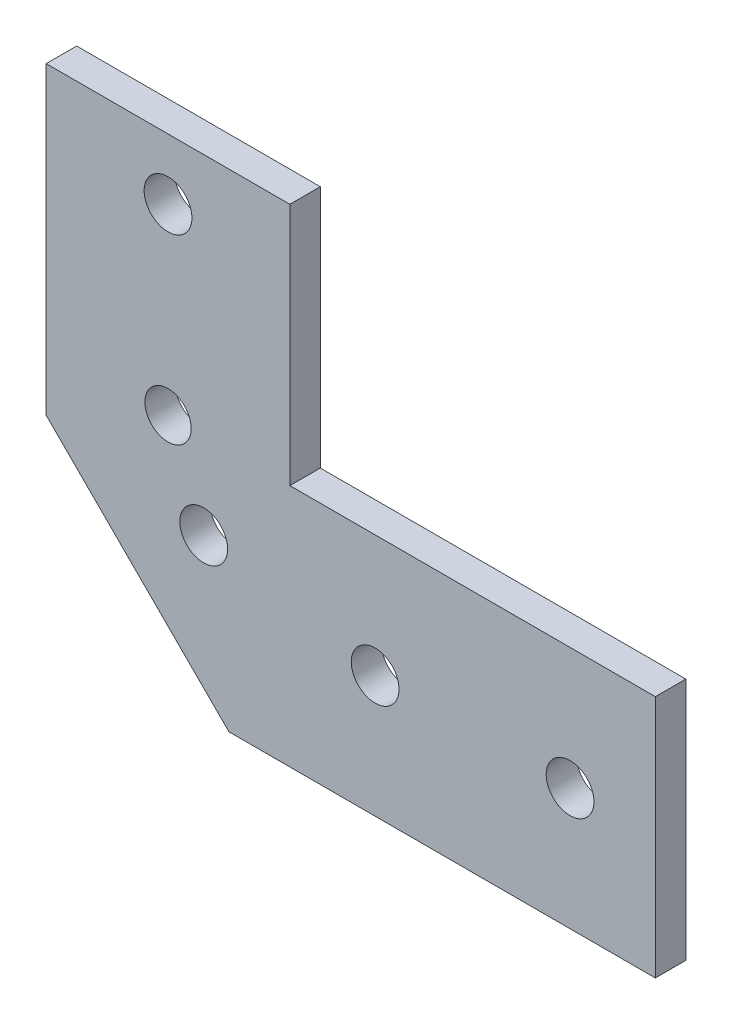
ISO-10303-21;
HEADER;
FILE_DESCRIPTION(('STEP AP214'),'2;1');
FILE_NAME('part.step','',(''),(''),'','','');
FILE_SCHEMA(('AUTOMOTIVE_DESIGN { 1 0 10303 214 1 1 1 1 }'));
ENDSEC;
DATA;
#1=APPLICATION_CONTEXT('core data for automotive mechanical design processes');
#2=APPLICATION_PROTOCOL_DEFINITION('international standard','automotive_design',2000,#1);
#3=PRODUCT_CONTEXT('',#1,'mechanical');
#4=PRODUCT('Part','Part','',(#3));
#5=PRODUCT_RELATED_PRODUCT_CATEGORY('part','',(#4));
#6=PRODUCT_DEFINITION_FORMATION('','',#4);
#7=PRODUCT_DEFINITION_CONTEXT('part definition',#1,'design');
#8=PRODUCT_DEFINITION('design','',#6,#7);
#9=PRODUCT_DEFINITION_SHAPE('','',#8);
#10=(LENGTH_UNIT() NAMED_UNIT(*) SI_UNIT(.MILLI.,.METRE.));
#11=(NAMED_UNIT(*) PLANE_ANGLE_UNIT() SI_UNIT($,.RADIAN.));
#12=(NAMED_UNIT(*) SI_UNIT($,.STERADIAN.) SOLID_ANGLE_UNIT());
#13=UNCERTAINTY_MEASURE_WITH_UNIT(LENGTH_MEASURE(1.E-05),#10,'distance_accuracy_value','');
#14=(GEOMETRIC_REPRESENTATION_CONTEXT(3) GLOBAL_UNCERTAINTY_ASSIGNED_CONTEXT((#13)) GLOBAL_UNIT_ASSIGNED_CONTEXT((#10,
#11,#12)) REPRESENTATION_CONTEXT('',''));
#15=CARTESIAN_POINT('',(0.,0.,0.));
#16=DIRECTION('',(0.,0.,1.));
#17=DIRECTION('',(1.,0.,0.));
#18=AXIS2_PLACEMENT_3D('',#15,#16,#17);
#19=CARTESIAN_POINT('',(0.,0.,3.175));
#20=DIRECTION('',(0.,1.,0.));
#21=DIRECTION('',(0.,0.,1.));
#22=AXIS2_PLACEMENT_3D('',#19,#20,#21);
#23=PLANE('',#22);
#24=DIRECTION('',(1.,0.,0.));
#25=VECTOR('',#24,1.);
#26=CARTESIAN_POINT('',(0.,0.,3.175));
#27=LINE('',#26,#25);
#28=CARTESIAN_POINT('',(19.05,0.,3.175));
#29=VERTEX_POINT('',#28);
#30=CARTESIAN_POINT('',(63.5,0.,3.175));
#31=VERTEX_POINT('',#30);
#32=EDGE_CURVE('E106',#29,#31,#27,.T.);
#33=ORIENTED_EDGE('',*,*,#32,.F.);
#34=DIRECTION('',(0.,0.,1.));
#35=VECTOR('',#34,1.);
#36=CARTESIAN_POINT('',(19.05,0.,0.));
#37=LINE('',#36,#35);
#38=CARTESIAN_POINT('',(19.05,0.,0.));
#39=VERTEX_POINT('',#38);
#40=EDGE_CURVE('E140',#39,#29,#37,.T.);
#41=ORIENTED_EDGE('',*,*,#40,.F.);
#42=DIRECTION('',(1.,0.,0.));
#43=VECTOR('',#42,1.);
#44=CARTESIAN_POINT('',(0.,0.,0.));
#45=LINE('',#44,#43);
#46=CARTESIAN_POINT('',(63.5,0.,0.));
#47=VERTEX_POINT('',#46);
#48=EDGE_CURVE('E129',#39,#47,#45,.T.);
#49=ORIENTED_EDGE('',*,*,#48,.T.);
#50=DIRECTION('',(0.,0.,-1.));
#51=VECTOR('',#50,1.);
#52=CARTESIAN_POINT('',(63.5,0.,3.175));
#53=LINE('',#52,#51);
#54=EDGE_CURVE('E11',#31,#47,#53,.T.);
#55=ORIENTED_EDGE('',*,*,#54,.F.);
#56=EDGE_LOOP('',(#33,#41,#49,#55));
#57=FACE_BOUND('',#56,.T.);
#58=ADVANCED_FACE('F32',(#57),#23,.F.);
#59=CARTESIAN_POINT('',(63.5,0.,3.175));
#60=DIRECTION('',(-1.,0.,0.));
#61=DIRECTION('',(0.,0.,1.));
#62=AXIS2_PLACEMENT_3D('',#59,#60,#61);
#63=PLANE('',#62);
#64=DIRECTION('',(0.,1.,0.));
#65=VECTOR('',#64,1.);
#66=CARTESIAN_POINT('',(63.5,0.,0.));
#67=LINE('',#66,#65);
#68=CARTESIAN_POINT('',(63.5,25.4,0.));
#69=VERTEX_POINT('',#68);
#70=EDGE_CURVE('E128',#47,#69,#67,.T.);
#71=ORIENTED_EDGE('',*,*,#70,.T.);
#72=DIRECTION('',(0.,0.,-1.));
#73=VECTOR('',#72,1.);
#74=CARTESIAN_POINT('',(63.5,25.4,3.175));
#75=LINE('',#74,#73);
#76=CARTESIAN_POINT('',(63.5,25.4,3.175));
#77=VERTEX_POINT('',#76);
#78=EDGE_CURVE('E39',#77,#69,#75,.T.);
#79=ORIENTED_EDGE('',*,*,#78,.F.);
#80=DIRECTION('',(0.,1.,0.));
#81=VECTOR('',#80,1.);
#82=CARTESIAN_POINT('',(63.5,0.,3.175));
#83=LINE('',#82,#81);
#84=EDGE_CURVE('E109',#31,#77,#83,.T.);
#85=ORIENTED_EDGE('',*,*,#84,.F.);
#86=ORIENTED_EDGE('',*,*,#54,.T.);
#87=EDGE_LOOP('',(#71,#79,#85,#86));
#88=FACE_BOUND('',#87,.T.);
#89=ADVANCED_FACE('F187',(#88),#63,.F.);
#90=CARTESIAN_POINT('',(63.5,25.4,3.175));
#91=DIRECTION('',(0.,-1.,0.));
#92=DIRECTION('',(1.,0.,0.));
#93=AXIS2_PLACEMENT_3D('',#90,#91,#92);
#94=PLANE('',#93);
#95=DIRECTION('',(-1.,0.,0.));
#96=VECTOR('',#95,1.);
#97=CARTESIAN_POINT('',(63.5,25.4,0.));
#98=LINE('',#97,#96);
#99=CARTESIAN_POINT('',(25.4,25.4,0.));
#100=VERTEX_POINT('',#99);
#101=EDGE_CURVE('E111',#69,#100,#98,.T.);
#102=ORIENTED_EDGE('',*,*,#101,.T.);
#103=DIRECTION('',(0.,0.,-1.));
#104=VECTOR('',#103,1.);
#105=CARTESIAN_POINT('',(25.4,25.4,3.175));
#106=LINE('',#105,#104);
#107=CARTESIAN_POINT('',(25.4,25.4,3.175));
#108=VERTEX_POINT('',#107);
#109=EDGE_CURVE('E115',#108,#100,#106,.T.);
#110=ORIENTED_EDGE('',*,*,#109,.F.);
#111=DIRECTION('',(-1.,0.,0.));
#112=VECTOR('',#111,1.);
#113=CARTESIAN_POINT('',(63.5,25.4,3.175));
#114=LINE('',#113,#112);
#115=EDGE_CURVE('E124',#77,#108,#114,.T.);
#116=ORIENTED_EDGE('',*,*,#115,.F.);
#117=ORIENTED_EDGE('',*,*,#78,.T.);
#118=EDGE_LOOP('',(#102,#110,#116,#117));
#119=FACE_BOUND('',#118,.T.);
#120=ADVANCED_FACE('F122',(#119),#94,.F.);
#121=CARTESIAN_POINT('',(25.4,25.4,3.175));
#122=DIRECTION('',(-1.,0.,0.));
#123=DIRECTION('',(0.,0.,1.));
#124=AXIS2_PLACEMENT_3D('',#121,#122,#123);
#125=PLANE('',#124);
#126=DIRECTION('',(0.,1.,0.));
#127=VECTOR('',#126,1.);
#128=CARTESIAN_POINT('',(25.4,25.4,0.));
#129=LINE('',#128,#127);
#130=CARTESIAN_POINT('',(25.4,50.8,0.));
#131=VERTEX_POINT('',#130);
#132=EDGE_CURVE('E107',#100,#131,#129,.T.);
#133=ORIENTED_EDGE('',*,*,#132,.T.);
#134=DIRECTION('',(0.,0.,1.));
#135=VECTOR('',#134,1.);
#136=CARTESIAN_POINT('',(25.4,50.8,0.));
#137=LINE('',#136,#135);
#138=CARTESIAN_POINT('',(25.4,50.8,3.175));
#139=VERTEX_POINT('',#138);
#140=EDGE_CURVE('E46',#131,#139,#137,.T.);
#141=ORIENTED_EDGE('',*,*,#140,.T.);
#142=DIRECTION('',(0.,1.,0.));
#143=VECTOR('',#142,1.);
#144=CARTESIAN_POINT('',(25.4,25.4,3.175));
#145=LINE('',#144,#143);
#146=EDGE_CURVE('E135',#108,#139,#145,.T.);
#147=ORIENTED_EDGE('',*,*,#146,.F.);
#148=ORIENTED_EDGE('',*,*,#109,.T.);
#149=EDGE_LOOP('',(#133,#141,#147,#148));
#150=FACE_BOUND('',#149,.T.);
#151=ADVANCED_FACE('F181',(#150),#125,.F.);
#152=CARTESIAN_POINT('',(0.,0.,3.175));
#153=DIRECTION('',(1.,0.,0.));
#154=DIRECTION('',(0.,0.,-1.));
#155=AXIS2_PLACEMENT_3D('',#152,#153,#154);
#156=PLANE('',#155);
#157=DIRECTION('',(0.,-1.,0.));
#158=VECTOR('',#157,1.);
#159=CARTESIAN_POINT('',(0.,0.,3.175));
#160=LINE('',#159,#158);
#161=CARTESIAN_POINT('',(0.,50.8,3.175));
#162=VERTEX_POINT('',#161);
#163=CARTESIAN_POINT('',(0.,19.0500000000001,3.175));
#164=VERTEX_POINT('',#163);
#165=EDGE_CURVE('E100',#162,#164,#160,.T.);
#166=ORIENTED_EDGE('',*,*,#165,.F.);
#167=DIRECTION('',(0.,0.,1.));
#168=VECTOR('',#167,1.);
#169=CARTESIAN_POINT('',(0.,50.8,0.));
#170=LINE('',#169,#168);
#171=CARTESIAN_POINT('',(0.,50.8,0.));
#172=VERTEX_POINT('',#171);
#173=EDGE_CURVE('E91',#172,#162,#170,.T.);
#174=ORIENTED_EDGE('',*,*,#173,.F.);
#175=DIRECTION('',(0.,-1.,0.));
#176=VECTOR('',#175,1.);
#177=CARTESIAN_POINT('',(0.,0.,0.));
#178=LINE('',#177,#176);
#179=CARTESIAN_POINT('',(0.,19.0500000000001,0.));
#180=VERTEX_POINT('',#179);
#181=EDGE_CURVE('E54',#172,#180,#178,.T.);
#182=ORIENTED_EDGE('',*,*,#181,.T.);
#183=DIRECTION('',(0.,0.,1.));
#184=VECTOR('',#183,1.);
#185=CARTESIAN_POINT('',(0.,19.0500000000001,0.));
#186=LINE('',#185,#184);
#187=EDGE_CURVE('E133',#180,#164,#186,.T.);
#188=ORIENTED_EDGE('',*,*,#187,.T.);
#189=EDGE_LOOP('',(#166,#174,#182,#188));
#190=FACE_BOUND('',#189,.T.);
#191=ADVANCED_FACE('F99',(#190),#156,.F.);
#192=CARTESIAN_POINT('',(0.,0.,3.175));
#193=DIRECTION('',(0.,0.,1.));
#194=DIRECTION('',(1.,0.,0.));
#195=AXIS2_PLACEMENT_3D('',#192,#193,#194);
#196=PLANE('',#195);
#197=DIRECTION('',(1.,0.,0.));
#198=VECTOR('',#197,1.);
#199=CARTESIAN_POINT('',(0.,50.8,3.175));
#200=LINE('',#199,#198);
#201=EDGE_CURVE('E96',#162,#139,#200,.T.);
#202=ORIENTED_EDGE('',*,*,#201,.F.);
#203=ORIENTED_EDGE('',*,*,#165,.T.);
#204=DIRECTION('',(-0.707106781186547,0.707106781186548,0.));
#205=VECTOR('',#204,1.);
#206=CARTESIAN_POINT('',(19.05,0.,3.175));
#207=LINE('',#206,#205);
#208=EDGE_CURVE('E143',#29,#164,#207,.T.);
#209=ORIENTED_EDGE('',*,*,#208,.F.);
#210=ORIENTED_EDGE('',*,*,#32,.T.);
#211=ORIENTED_EDGE('',*,*,#84,.T.);
#212=ORIENTED_EDGE('',*,*,#115,.T.);
#213=ORIENTED_EDGE('',*,*,#146,.T.);
#214=EDGE_LOOP('',(#202,#203,#209,#210,#211,#212,#213));
#215=FACE_BOUND('',#214,.T.);
#216=CARTESIAN_POINT('',(12.7,25.4,3.175));
#217=DIRECTION('',(0.,0.,-1.));
#218=DIRECTION('',(-1.,0.,0.));
#219=AXIS2_PLACEMENT_3D('',#216,#217,#218);
#220=CIRCLE('',#219,2.41300000000006);
#221=CARTESIAN_POINT('',(10.2869999999999,25.4,3.175));
#222=VERTEX_POINT('',#221);
#223=EDGE_CURVE('E152',#222,#222,#220,.T.);
#224=ORIENTED_EDGE('',*,*,#223,.T.);
#225=EDGE_LOOP('',(#224));
#226=FACE_BOUND('',#225,.T.);
#227=CARTESIAN_POINT('',(54.61,12.7,3.175));
#228=DIRECTION('',(0.,0.,1.));
#229=DIRECTION('',(-1.,0.,0.));
#230=AXIS2_PLACEMENT_3D('',#227,#228,#229);
#231=CIRCLE('',#230,2.4892);
#232=CARTESIAN_POINT('',(52.1208,12.7,3.175));
#233=VERTEX_POINT('',#232);
#234=EDGE_CURVE('E148',#233,#233,#231,.T.);
#235=ORIENTED_EDGE('',*,*,#234,.F.);
#236=EDGE_LOOP('',(#235));
#237=FACE_BOUND('',#236,.T.);
#238=CARTESIAN_POINT('',(16.4197438789308,16.4197438789308,3.175));
#239=DIRECTION('',(0.,0.,1.));
#240=DIRECTION('',(1.,0.,0.));
#241=AXIS2_PLACEMENT_3D('',#238,#239,#240);
#242=CIRCLE('',#241,2.48919999999999);
#243=CARTESIAN_POINT('',(18.9089438789308,16.4197438789308,3.175));
#244=VERTEX_POINT('',#243);
#245=EDGE_CURVE('E155',#244,#244,#242,.T.);
#246=ORIENTED_EDGE('',*,*,#245,.F.);
#247=EDGE_LOOP('',(#246));
#248=FACE_BOUND('',#247,.T.);
#249=CARTESIAN_POINT('',(34.29,12.7,3.175));
#250=DIRECTION('',(0.,0.,1.));
#251=DIRECTION('',(-1.,0.,0.));
#252=AXIS2_PLACEMENT_3D('',#249,#250,#251);
#253=CIRCLE('',#252,2.4892);
#254=CARTESIAN_POINT('',(31.8008,12.7,3.175));
#255=VERTEX_POINT('',#254);
#256=EDGE_CURVE('E161',#255,#255,#253,.T.);
#257=ORIENTED_EDGE('',*,*,#256,.F.);
#258=EDGE_LOOP('',(#257));
#259=FACE_BOUND('',#258,.T.);
#260=CARTESIAN_POINT('',(12.7,44.45,3.175));
#261=DIRECTION('',(0.,0.,1.));
#262=DIRECTION('',(1.,0.,0.));
#263=AXIS2_PLACEMENT_3D('',#260,#261,#262);
#264=CIRCLE('',#263,2.4892);
#265=CARTESIAN_POINT('',(15.1892,44.45,3.175));
#266=VERTEX_POINT('',#265);
#267=EDGE_CURVE('E167',#266,#266,#264,.T.);
#268=ORIENTED_EDGE('',*,*,#267,.F.);
#269=EDGE_LOOP('',(#268));
#270=FACE_BOUND('',#269,.T.);
#271=ADVANCED_FACE('F182',(#215,#226,#237,#248,#259,#270),#196,.T.);
#272=CARTESIAN_POINT('',(0.,0.,0.));
#273=DIRECTION('',(0.,0.,1.));
#274=DIRECTION('',(1.,0.,0.));
#275=AXIS2_PLACEMENT_3D('',#272,#273,#274);
#276=PLANE('',#275);
#277=CARTESIAN_POINT('',(12.7,25.4,0.));
#278=DIRECTION('',(0.,0.,-1.));
#279=DIRECTION('',(-1.,0.,0.));
#280=AXIS2_PLACEMENT_3D('',#277,#278,#279);
#281=CIRCLE('',#280,2.41300000000006);
#282=CARTESIAN_POINT('',(10.2869999999999,25.4,0.));
#283=VERTEX_POINT('',#282);
#284=EDGE_CURVE('E172',#283,#283,#281,.T.);
#285=ORIENTED_EDGE('',*,*,#284,.F.);
#286=EDGE_LOOP('',(#285));
#287=FACE_BOUND('',#286,.T.);
#288=CARTESIAN_POINT('',(54.61,12.7,0.));
#289=DIRECTION('',(0.,0.,1.));
#290=DIRECTION('',(-1.,0.,0.));
#291=AXIS2_PLACEMENT_3D('',#288,#289,#290);
#292=CIRCLE('',#291,2.4892);
#293=CARTESIAN_POINT('',(52.1208,12.7,0.));
#294=VERTEX_POINT('',#293);
#295=EDGE_CURVE('E151',#294,#294,#292,.T.);
#296=ORIENTED_EDGE('',*,*,#295,.T.);
#297=EDGE_LOOP('',(#296));
#298=FACE_BOUND('',#297,.T.);
#299=CARTESIAN_POINT('',(16.4197438789308,16.4197438789308,0.));
#300=DIRECTION('',(0.,0.,1.));
#301=DIRECTION('',(1.,0.,0.));
#302=AXIS2_PLACEMENT_3D('',#299,#300,#301);
#303=CIRCLE('',#302,2.48919999999999);
#304=CARTESIAN_POINT('',(18.9089438789308,16.4197438789308,0.));
#305=VERTEX_POINT('',#304);
#306=EDGE_CURVE('E158',#305,#305,#303,.T.);
#307=ORIENTED_EDGE('',*,*,#306,.T.);
#308=EDGE_LOOP('',(#307));
#309=FACE_BOUND('',#308,.T.);
#310=CARTESIAN_POINT('',(34.29,12.7,0.));
#311=DIRECTION('',(0.,0.,1.));
#312=DIRECTION('',(-1.,0.,0.));
#313=AXIS2_PLACEMENT_3D('',#310,#311,#312);
#314=CIRCLE('',#313,2.4892);
#315=CARTESIAN_POINT('',(31.8008,12.7,0.));
#316=VERTEX_POINT('',#315);
#317=EDGE_CURVE('E164',#316,#316,#314,.T.);
#318=ORIENTED_EDGE('',*,*,#317,.T.);
#319=EDGE_LOOP('',(#318));
#320=FACE_BOUND('',#319,.T.);
#321=CARTESIAN_POINT('',(12.7,44.45,0.));
#322=DIRECTION('',(0.,0.,1.));
#323=DIRECTION('',(1.,0.,0.));
#324=AXIS2_PLACEMENT_3D('',#321,#322,#323);
#325=CIRCLE('',#324,2.4892);
#326=CARTESIAN_POINT('',(15.1892,44.45,0.));
#327=VERTEX_POINT('',#326);
#328=EDGE_CURVE('E146',#327,#327,#325,.T.);
#329=ORIENTED_EDGE('',*,*,#328,.T.);
#330=EDGE_LOOP('',(#329));
#331=FACE_BOUND('',#330,.T.);
#332=ORIENTED_EDGE('',*,*,#181,.F.);
#333=DIRECTION('',(1.,0.,0.));
#334=VECTOR('',#333,1.);
#335=CARTESIAN_POINT('',(0.,50.8,0.));
#336=LINE('',#335,#334);
#337=EDGE_CURVE('E89',#172,#131,#336,.T.);
#338=ORIENTED_EDGE('',*,*,#337,.T.);
#339=ORIENTED_EDGE('',*,*,#132,.F.);
#340=ORIENTED_EDGE('',*,*,#101,.F.);
#341=ORIENTED_EDGE('',*,*,#70,.F.);
#342=ORIENTED_EDGE('',*,*,#48,.F.);
#343=DIRECTION('',(-0.707106781186547,0.707106781186548,0.));
#344=VECTOR('',#343,1.);
#345=CARTESIAN_POINT('',(19.05,0.,0.));
#346=LINE('',#345,#344);
#347=EDGE_CURVE('E105',#39,#180,#346,.T.);
#348=ORIENTED_EDGE('',*,*,#347,.T.);
#349=EDGE_LOOP('',(#332,#338,#339,#340,#341,#342,#348));
#350=FACE_BOUND('',#349,.T.);
#351=ADVANCED_FACE('F103',(#287,#298,#309,#320,#331,#350),#276,.F.);
#352=CARTESIAN_POINT('',(19.05,0.,0.));
#353=DIRECTION('',(0.707106781186548,0.707106781186547,0.));
#354=DIRECTION('',(-0.707106781186547,0.707106781186548,0.));
#355=AXIS2_PLACEMENT_3D('',#352,#353,#354);
#356=PLANE('',#355);
#357=ORIENTED_EDGE('',*,*,#208,.T.);
#358=ORIENTED_EDGE('',*,*,#187,.F.);
#359=ORIENTED_EDGE('',*,*,#347,.F.);
#360=ORIENTED_EDGE('',*,*,#40,.T.);
#361=EDGE_LOOP('',(#357,#358,#359,#360));
#362=FACE_BOUND('',#361,.T.);
#363=ADVANCED_FACE('F191',(#362),#356,.F.);
#364=CARTESIAN_POINT('',(12.7,44.45,0.));
#365=DIRECTION('',(0.,0.,1.));
#366=DIRECTION('',(1.,0.,0.));
#367=AXIS2_PLACEMENT_3D('',#364,#365,#366);
#368=CYLINDRICAL_SURFACE('',#367,2.4892);
#369=ORIENTED_EDGE('',*,*,#328,.F.);
#370=EDGE_LOOP('',(#369));
#371=FACE_BOUND('',#370,.T.);
#372=ORIENTED_EDGE('',*,*,#267,.T.);
#373=EDGE_LOOP('',(#372));
#374=FACE_BOUND('',#373,.T.);
#375=ADVANCED_FACE('F193',(#371,#374),#368,.F.);
#376=CARTESIAN_POINT('',(34.29,12.7,0.));
#377=DIRECTION('',(0.,0.,1.));
#378=DIRECTION('',(1.,0.,0.));
#379=AXIS2_PLACEMENT_3D('',#376,#377,#378);
#380=CYLINDRICAL_SURFACE('',#379,2.4892);
#381=ORIENTED_EDGE('',*,*,#317,.F.);
#382=EDGE_LOOP('',(#381));
#383=FACE_BOUND('',#382,.T.);
#384=ORIENTED_EDGE('',*,*,#256,.T.);
#385=EDGE_LOOP('',(#384));
#386=FACE_BOUND('',#385,.T.);
#387=ADVANCED_FACE('F199',(#383,#386),#380,.F.);
#388=CARTESIAN_POINT('',(16.4197438789308,16.4197438789308,0.));
#389=DIRECTION('',(0.,0.,1.));
#390=DIRECTION('',(1.,0.,0.));
#391=AXIS2_PLACEMENT_3D('',#388,#389,#390);
#392=CYLINDRICAL_SURFACE('',#391,2.48919999999999);
#393=ORIENTED_EDGE('',*,*,#306,.F.);
#394=EDGE_LOOP('',(#393));
#395=FACE_BOUND('',#394,.T.);
#396=ORIENTED_EDGE('',*,*,#245,.T.);
#397=EDGE_LOOP('',(#396));
#398=FACE_BOUND('',#397,.T.);
#399=ADVANCED_FACE('F254',(#395,#398),#392,.F.);
#400=CARTESIAN_POINT('',(54.61,12.7,0.));
#401=DIRECTION('',(0.,0.,1.));
#402=DIRECTION('',(1.,0.,0.));
#403=AXIS2_PLACEMENT_3D('',#400,#401,#402);
#404=CYLINDRICAL_SURFACE('',#403,2.4892);
#405=ORIENTED_EDGE('',*,*,#295,.F.);
#406=EDGE_LOOP('',(#405));
#407=FACE_BOUND('',#406,.T.);
#408=ORIENTED_EDGE('',*,*,#234,.T.);
#409=EDGE_LOOP('',(#408));
#410=FACE_BOUND('',#409,.T.);
#411=ADVANCED_FACE('F246',(#407,#410),#404,.F.);
#412=CARTESIAN_POINT('',(12.7,25.4,3.175));
#413=DIRECTION('',(0.,0.,-1.));
#414=DIRECTION('',(-1.,0.,0.));
#415=AXIS2_PLACEMENT_3D('',#412,#413,#414);
#416=CYLINDRICAL_SURFACE('',#415,2.41300000000006);
#417=ORIENTED_EDGE('',*,*,#223,.F.);
#418=EDGE_LOOP('',(#417));
#419=FACE_BOUND('',#418,.T.);
#420=ORIENTED_EDGE('',*,*,#284,.T.);
#421=EDGE_LOOP('',(#420));
#422=FACE_BOUND('',#421,.T.);
#423=ADVANCED_FACE('F236',(#419,#422),#416,.F.);
#424=CARTESIAN_POINT('',(0.,50.8,0.));
#425=DIRECTION('',(0.,-1.,0.));
#426=DIRECTION('',(0.,0.,-1.));
#427=AXIS2_PLACEMENT_3D('',#424,#425,#426);
#428=PLANE('',#427);
#429=ORIENTED_EDGE('',*,*,#201,.T.);
#430=ORIENTED_EDGE('',*,*,#140,.F.);
#431=ORIENTED_EDGE('',*,*,#337,.F.);
#432=ORIENTED_EDGE('',*,*,#173,.T.);
#433=EDGE_LOOP('',(#429,#430,#431,#432));
#434=FACE_BOUND('',#433,.T.);
#435=ADVANCED_FACE('F90',(#434),#428,.F.);
#436=CLOSED_SHELL('',(#58,#89,#120,#151,#191,#271,#351,#363,#375,#387,#399,#411,#423,#435));
#437=MANIFOLD_SOLID_BREP('B2',#436);
#438=ADVANCED_BREP_SHAPE_REPRESENTATION('',(#18,#437),#14);
#439=SHAPE_DEFINITION_REPRESENTATION(#9,#438);
ENDSEC;
END-ISO-10303-21;
